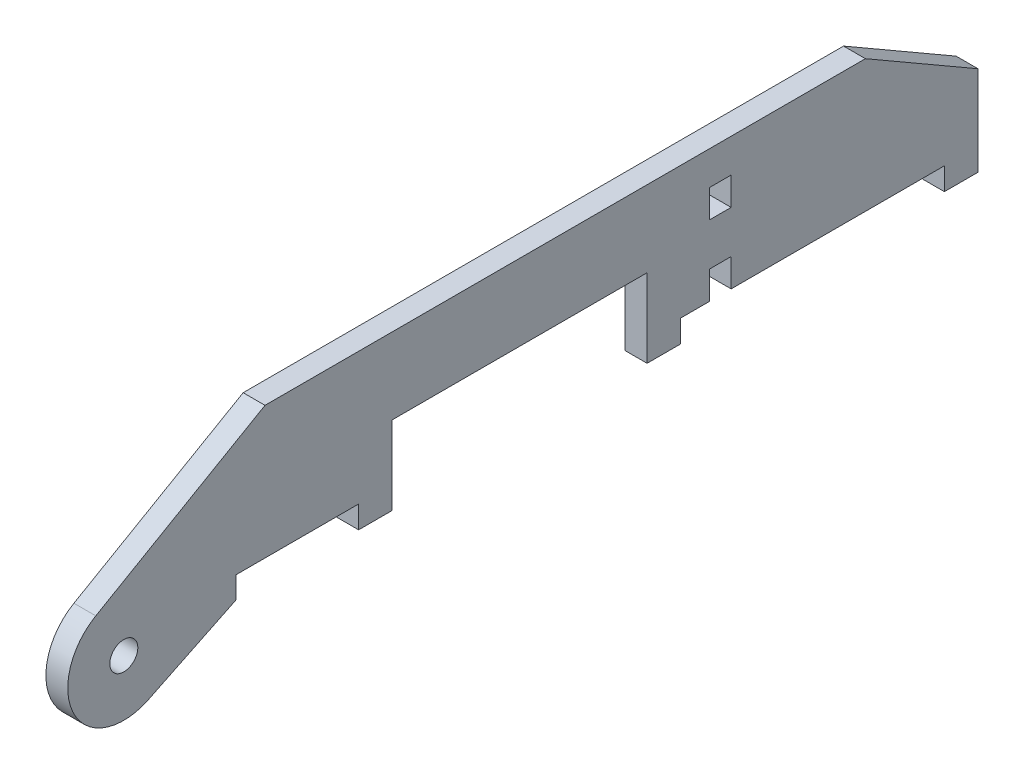
ISO-10303-21;
HEADER;
FILE_DESCRIPTION(('STEP AP214'),'2;1');
FILE_NAME('part.step','',(''),(''),'','','');
FILE_SCHEMA(('AUTOMOTIVE_DESIGN { 1 0 10303 214 1 1 1 1 }'));
ENDSEC;
DATA;
#1=APPLICATION_CONTEXT('core data for automotive mechanical design processes');
#2=APPLICATION_PROTOCOL_DEFINITION('international standard','automotive_design',2000,#1);
#3=PRODUCT_CONTEXT('',#1,'mechanical');
#4=PRODUCT('Part','Part','',(#3));
#5=PRODUCT_RELATED_PRODUCT_CATEGORY('part','',(#4));
#6=PRODUCT_DEFINITION_FORMATION('','',#4);
#7=PRODUCT_DEFINITION_CONTEXT('part definition',#1,'design');
#8=PRODUCT_DEFINITION('design','',#6,#7);
#9=PRODUCT_DEFINITION_SHAPE('','',#8);
#10=(LENGTH_UNIT() NAMED_UNIT(*) SI_UNIT(.MILLI.,.METRE.));
#11=(NAMED_UNIT(*) PLANE_ANGLE_UNIT() SI_UNIT($,.RADIAN.));
#12=(NAMED_UNIT(*) SI_UNIT($,.STERADIAN.) SOLID_ANGLE_UNIT());
#13=UNCERTAINTY_MEASURE_WITH_UNIT(LENGTH_MEASURE(1.E-05),#10,'distance_accuracy_value','');
#14=(GEOMETRIC_REPRESENTATION_CONTEXT(3) GLOBAL_UNCERTAINTY_ASSIGNED_CONTEXT((#13)) GLOBAL_UNIT_ASSIGNED_CONTEXT((#10,
#11,#12)) REPRESENTATION_CONTEXT('',''));
#15=CARTESIAN_POINT('',(0.,0.,0.));
#16=DIRECTION('',(0.,0.,1.));
#17=DIRECTION('',(1.,0.,0.));
#18=AXIS2_PLACEMENT_3D('',#15,#16,#17);
#19=CARTESIAN_POINT('',(2.4765,51.3143053538504,147.857292876109));
#20=DIRECTION('',(1.,0.,0.));
#21=DIRECTION('',(0.,0.,-1.));
#22=AXIS2_PLACEMENT_3D('',#19,#20,#21);
#23=PLANE('',#22);
#24=DIRECTION('',(0.,1.,0.));
#25=VECTOR('',#24,1.);
#26=CARTESIAN_POINT('',(2.4765,54.483,122.457292876109));
#27=LINE('',#26,#25);
#28=CARTESIAN_POINT('',(2.4765,49.53,122.457292876109));
#29=VERTEX_POINT('',#28);
#30=CARTESIAN_POINT('',(2.4765,54.483,122.457292876109));
#31=VERTEX_POINT('',#30);
#32=EDGE_CURVE('E248',#29,#31,#27,.T.);
#33=ORIENTED_EDGE('',*,*,#32,.T.);
#34=DIRECTION('',(0.,0.,-1.));
#35=VECTOR('',#34,1.);
#36=CARTESIAN_POINT('',(2.4765,54.483,94.6423658094959));
#37=LINE('',#36,#35);
#38=CARTESIAN_POINT('',(2.4765,54.483,94.6423658094959));
#39=VERTEX_POINT('',#38);
#40=EDGE_CURVE('E251',#31,#39,#37,.T.);
#41=ORIENTED_EDGE('',*,*,#40,.T.);
#42=DIRECTION('',(0.,-1.,0.));
#43=VECTOR('',#42,1.);
#44=CARTESIAN_POINT('',(2.4765,54.483,94.6423658094959));
#45=LINE('',#44,#43);
#46=CARTESIAN_POINT('',(2.4765,49.403,94.6423658094959));
#47=VERTEX_POINT('',#46);
#48=EDGE_CURVE('E254',#39,#47,#45,.T.);
#49=ORIENTED_EDGE('',*,*,#48,.T.);
#50=DIRECTION('',(0.,0.,-1.));
#51=VECTOR('',#50,1.);
#52=CARTESIAN_POINT('',(2.4765,49.403,87.022365809496));
#53=LINE('',#52,#51);
#54=CARTESIAN_POINT('',(2.4765,49.403,87.022365809496));
#55=VERTEX_POINT('',#54);
#56=EDGE_CURVE('E256',#47,#55,#53,.T.);
#57=ORIENTED_EDGE('',*,*,#56,.T.);
#58=DIRECTION('',(0.,1.,0.));
#59=VECTOR('',#58,1.);
#60=CARTESIAN_POINT('',(2.4765,49.403,87.022365809496));
#61=LINE('',#60,#59);
#62=CARTESIAN_POINT('',(2.4765,67.183,87.022365809496));
#63=VERTEX_POINT('',#62);
#64=EDGE_CURVE('E258',#55,#63,#61,.T.);
#65=ORIENTED_EDGE('',*,*,#64,.T.);
#66=DIRECTION('',(0.,0.,-1.));
#67=VECTOR('',#66,1.);
#68=CARTESIAN_POINT('',(2.4765,67.183,87.022365809496));
#69=LINE('',#68,#67);
#70=CARTESIAN_POINT('',(2.4765,67.183,29.2718566261337));
#71=VERTEX_POINT('',#70);
#72=EDGE_CURVE('E260',#63,#71,#69,.T.);
#73=ORIENTED_EDGE('',*,*,#72,.T.);
#74=DIRECTION('',(0.,-1.,0.));
#75=VECTOR('',#74,1.);
#76=CARTESIAN_POINT('',(2.4765,49.403,29.2718566261337));
#77=LINE('',#76,#75);
#78=CARTESIAN_POINT('',(2.4765,49.403,29.2718566261337));
#79=VERTEX_POINT('',#78);
#80=EDGE_CURVE('E262',#71,#79,#77,.T.);
#81=ORIENTED_EDGE('',*,*,#80,.T.);
#82=DIRECTION('',(0.,0.,-1.));
#83=VECTOR('',#82,1.);
#84=CARTESIAN_POINT('',(2.4765,49.403,29.2718566261337));
#85=LINE('',#84,#83);
#86=CARTESIAN_POINT('',(2.4765,49.403,21.6518566261337));
#87=VERTEX_POINT('',#86);
#88=EDGE_CURVE('E264',#79,#87,#85,.T.);
#89=ORIENTED_EDGE('',*,*,#88,.T.);
#90=DIRECTION('',(0.,1.,0.));
#91=VECTOR('',#90,1.);
#92=CARTESIAN_POINT('',(2.4765,54.483,21.6518566261337));
#93=LINE('',#92,#91);
#94=CARTESIAN_POINT('',(2.4765,54.483,21.6518566261337));
#95=VERTEX_POINT('',#94);
#96=EDGE_CURVE('E266',#87,#95,#93,.T.);
#97=ORIENTED_EDGE('',*,*,#96,.T.);
#98=DIRECTION('',(0.,0.,-1.));
#99=VECTOR('',#98,1.);
#100=CARTESIAN_POINT('',(2.4765,54.483,21.6518566261337));
#101=LINE('',#100,#99);
#102=CARTESIAN_POINT('',(2.4765,54.483,15.1765));
#103=VERTEX_POINT('',#102);
#104=EDGE_CURVE('E268',#95,#103,#101,.T.);
#105=ORIENTED_EDGE('',*,*,#104,.T.);
#106=DIRECTION('',(0.,1.,0.));
#107=VECTOR('',#106,1.);
#108=CARTESIAN_POINT('',(2.4765,54.483,15.1765));
#109=LINE('',#108,#107);
#110=CARTESIAN_POINT('',(2.4765,60.833,15.1765));
#111=VERTEX_POINT('',#110);
#112=EDGE_CURVE('E270',#103,#111,#109,.T.);
#113=ORIENTED_EDGE('',*,*,#112,.T.);
#114=DIRECTION('',(0.,0.,-1.));
#115=VECTOR('',#114,1.);
#116=CARTESIAN_POINT('',(2.4765,60.833,15.1765));
#117=LINE('',#116,#115);
#118=CARTESIAN_POINT('',(2.4765,60.833,10.2235));
#119=VERTEX_POINT('',#118);
#120=EDGE_CURVE('E272',#111,#119,#117,.T.);
#121=ORIENTED_EDGE('',*,*,#120,.T.);
#122=DIRECTION('',(0.,-1.,0.));
#123=VECTOR('',#122,1.);
#124=CARTESIAN_POINT('',(2.4765,54.483,10.2235));
#125=LINE('',#124,#123);
#126=CARTESIAN_POINT('',(2.4765,54.483,10.2235));
#127=VERTEX_POINT('',#126);
#128=EDGE_CURVE('E274',#119,#127,#125,.T.);
#129=ORIENTED_EDGE('',*,*,#128,.T.);
#130=DIRECTION('',(0.,0.,-1.));
#131=VECTOR('',#130,1.);
#132=CARTESIAN_POINT('',(2.4765,54.483,10.2235));
#133=LINE('',#132,#131);
#134=CARTESIAN_POINT('',(2.4765,54.483,-38.1));
#135=VERTEX_POINT('',#134);
#136=EDGE_CURVE('E276',#127,#135,#133,.T.);
#137=ORIENTED_EDGE('',*,*,#136,.T.);
#138=DIRECTION('',(0.,-1.,0.));
#139=VECTOR('',#138,1.);
#140=CARTESIAN_POINT('',(2.4765,54.483,-38.1));
#141=LINE('',#140,#139);
#142=CARTESIAN_POINT('',(2.4765,49.403,-38.1));
#143=VERTEX_POINT('',#142);
#144=EDGE_CURVE('E278',#135,#143,#141,.T.);
#145=ORIENTED_EDGE('',*,*,#144,.T.);
#146=DIRECTION('',(0.,0.,-1.));
#147=VECTOR('',#146,1.);
#148=CARTESIAN_POINT('',(2.4765,49.403,-45.72));
#149=LINE('',#148,#147);
#150=CARTESIAN_POINT('',(2.4765,49.403,-45.72));
#151=VERTEX_POINT('',#150);
#152=EDGE_CURVE('E280',#143,#151,#149,.T.);
#153=ORIENTED_EDGE('',*,*,#152,.T.);
#154=DIRECTION('',(0.,1.,0.));
#155=VECTOR('',#154,1.);
#156=CARTESIAN_POINT('',(2.4765,49.403,-45.72));
#157=LINE('',#156,#155);
#158=CARTESIAN_POINT('',(2.4765,69.723,-45.72));
#159=VERTEX_POINT('',#158);
#160=EDGE_CURVE('E282',#151,#159,#157,.T.);
#161=ORIENTED_EDGE('',*,*,#160,.T.);
#162=DIRECTION('',(0.,0.500000000000001,0.866025403784438));
#163=VECTOR('',#162,1.);
#164=CARTESIAN_POINT('',(2.4765,69.723,-45.72));
#165=LINE('',#164,#163);
#166=CARTESIAN_POINT('',(2.4765,84.455,-20.2034275028954));
#167=VERTEX_POINT('',#166);
#168=EDGE_CURVE('E284',#159,#167,#165,.T.);
#169=ORIENTED_EDGE('',*,*,#168,.T.);
#170=DIRECTION('',(0.,0.,1.));
#171=VECTOR('',#170,1.);
#172=CARTESIAN_POINT('',(2.4765,84.455,-20.2034275028954));
#173=LINE('',#172,#171);
#174=CARTESIAN_POINT('',(2.4765,84.455,115.855925950851));
#175=VERTEX_POINT('',#174);
#176=EDGE_CURVE('E286',#167,#175,#173,.T.);
#177=ORIENTED_EDGE('',*,*,#176,.T.);
#178=DIRECTION('',(0.,-0.499999999999995,0.866025403784442));
#179=VECTOR('',#178,1.);
#180=CARTESIAN_POINT('',(2.4765,62.3128279819128,154.207292876109));
#181=LINE('',#180,#179);
#182=CARTESIAN_POINT('',(2.4765,62.3128279819128,154.207292876109));
#183=VERTEX_POINT('',#182);
#184=EDGE_CURVE('E288',#175,#183,#181,.T.);
#185=ORIENTED_EDGE('',*,*,#184,.T.);
#186=CARTESIAN_POINT('',(2.4765,51.3143053538504,147.857292876109));
#187=DIRECTION('',(1.,0.,0.));
#188=DIRECTION('',(0.,0.,-1.));
#189=AXIS2_PLACEMENT_3D('',#186,#187,#188);
#190=CIRCLE('',#189,12.7);
#191=CARTESIAN_POINT('',(2.4765,39.8899589675904,142.309833128914));
#192=VERTEX_POINT('',#191);
#193=EDGE_CURVE('E290',#183,#192,#190,.T.);
#194=ORIENTED_EDGE('',*,*,#193,.T.);
#195=DIRECTION('',(0.,0.436807854109848,-0.899554833563774));
#196=VECTOR('',#195,1.);
#197=CARTESIAN_POINT('',(2.4765,49.53,122.457292876109));
#198=LINE('',#197,#196);
#199=EDGE_CURVE('E292',#192,#29,#198,.T.);
#200=ORIENTED_EDGE('',*,*,#199,.T.);
#201=EDGE_LOOP('',(#33,#41,#49,#57,#65,#73,#81,#89,#97,#105,#113,#121,#129,#137,#145,#153,#161,
#169,#177,#185,#194,#200));
#202=FACE_BOUND('',#201,.T.);
#203=CARTESIAN_POINT('',(2.4765,51.3143053538504,147.857292876109));
#204=DIRECTION('',(1.,0.,0.));
#205=DIRECTION('',(0.,0.,-1.));
#206=AXIS2_PLACEMENT_3D('',#203,#204,#205);
#207=CIRCLE('',#206,3.1749999999999);
#208=CARTESIAN_POINT('',(2.4765,51.3143053538504,144.682292876109));
#209=VERTEX_POINT('',#208);
#210=EDGE_CURVE('E242',#209,#209,#207,.T.);
#211=ORIENTED_EDGE('',*,*,#210,.F.);
#212=EDGE_LOOP('',(#211));
#213=FACE_BOUND('',#212,.T.);
#214=DIRECTION('',(0.,0.,1.));
#215=VECTOR('',#214,1.);
#216=CARTESIAN_POINT('',(2.4765,76.835,10.2235));
#217=LINE('',#216,#215);
#218=CARTESIAN_POINT('',(2.4765,76.835,10.2235));
#219=VERTEX_POINT('',#218);
#220=CARTESIAN_POINT('',(2.4765,76.835,15.1765));
#221=VERTEX_POINT('',#220);
#222=EDGE_CURVE('E214',#219,#221,#217,.T.);
#223=ORIENTED_EDGE('',*,*,#222,.F.);
#224=DIRECTION('',(0.,1.,0.));
#225=VECTOR('',#224,1.);
#226=CARTESIAN_POINT('',(2.4765,76.835,10.2235));
#227=LINE('',#226,#225);
#228=CARTESIAN_POINT('',(2.4765,70.485,10.2235));
#229=VERTEX_POINT('',#228);
#230=EDGE_CURVE('E206',#229,#219,#227,.T.);
#231=ORIENTED_EDGE('',*,*,#230,.F.);
#232=DIRECTION('',(0.,0.,-1.));
#233=VECTOR('',#232,1.);
#234=CARTESIAN_POINT('',(2.4765,70.485,10.2235));
#235=LINE('',#234,#233);
#236=CARTESIAN_POINT('',(2.4765,70.485,15.1765));
#237=VERTEX_POINT('',#236);
#238=EDGE_CURVE('E228',#237,#229,#235,.T.);
#239=ORIENTED_EDGE('',*,*,#238,.F.);
#240=DIRECTION('',(0.,-1.,0.));
#241=VECTOR('',#240,1.);
#242=CARTESIAN_POINT('',(2.4765,76.835,15.1765));
#243=LINE('',#242,#241);
#244=EDGE_CURVE('E226',#221,#237,#243,.T.);
#245=ORIENTED_EDGE('',*,*,#244,.F.);
#246=EDGE_LOOP('',(#223,#231,#239,#245));
#247=FACE_BOUND('',#246,.T.);
#248=ADVANCED_FACE('F33',(#202,#213,#247),#23,.T.);
#249=CARTESIAN_POINT('',(-2.4765,51.3143053538504,147.857292876109));
#250=DIRECTION('',(1.,0.,0.));
#251=DIRECTION('',(0.,0.,-1.));
#252=AXIS2_PLACEMENT_3D('',#249,#250,#251);
#253=PLANE('',#252);
#254=CARTESIAN_POINT('',(-2.4765,51.3143053538504,147.857292876109));
#255=DIRECTION('',(1.,0.,0.));
#256=DIRECTION('',(0.,0.,-1.));
#257=AXIS2_PLACEMENT_3D('',#254,#255,#256);
#258=CIRCLE('',#257,3.1749999999999);
#259=CARTESIAN_POINT('',(-2.4765,51.3143053538504,144.682292876109));
#260=VERTEX_POINT('',#259);
#261=EDGE_CURVE('E222',#260,#260,#258,.T.);
#262=ORIENTED_EDGE('',*,*,#261,.T.);
#263=EDGE_LOOP('',(#262));
#264=FACE_BOUND('',#263,.T.);
#265=DIRECTION('',(0.,1.,0.));
#266=VECTOR('',#265,1.);
#267=CARTESIAN_POINT('',(-2.4765,54.483,122.457292876109));
#268=LINE('',#267,#266);
#269=CARTESIAN_POINT('',(-2.4765,49.53,122.457292876109));
#270=VERTEX_POINT('',#269);
#271=CARTESIAN_POINT('',(-2.4765,54.483,122.457292876109));
#272=VERTEX_POINT('',#271);
#273=EDGE_CURVE('E245',#270,#272,#268,.T.);
#274=ORIENTED_EDGE('',*,*,#273,.F.);
#275=DIRECTION('',(0.,0.436807854109848,-0.899554833563774));
#276=VECTOR('',#275,1.);
#277=CARTESIAN_POINT('',(-2.4765,49.53,122.457292876109));
#278=LINE('',#277,#276);
#279=CARTESIAN_POINT('',(-2.4765,39.8899589675904,142.309833128914));
#280=VERTEX_POINT('',#279);
#281=EDGE_CURVE('E252',#280,#270,#278,.T.);
#282=ORIENTED_EDGE('',*,*,#281,.F.);
#283=CARTESIAN_POINT('',(-2.4765,51.3143053538504,147.857292876109));
#284=DIRECTION('',(1.,0.,0.));
#285=DIRECTION('',(0.,0.,-1.));
#286=AXIS2_PLACEMENT_3D('',#283,#284,#285);
#287=CIRCLE('',#286,12.7);
#288=CARTESIAN_POINT('',(-2.4765,62.3128279819128,154.207292876109));
#289=VERTEX_POINT('',#288);
#290=EDGE_CURVE('E335',#289,#280,#287,.T.);
#291=ORIENTED_EDGE('',*,*,#290,.F.);
#292=DIRECTION('',(0.,-0.499999999999995,0.866025403784442));
#293=VECTOR('',#292,1.);
#294=CARTESIAN_POINT('',(-2.4765,62.3128279819128,154.207292876109));
#295=LINE('',#294,#293);
#296=CARTESIAN_POINT('',(-2.4765,84.455,115.855925950851));
#297=VERTEX_POINT('',#296);
#298=EDGE_CURVE('E333',#297,#289,#295,.T.);
#299=ORIENTED_EDGE('',*,*,#298,.F.);
#300=DIRECTION('',(0.,0.,1.));
#301=VECTOR('',#300,1.);
#302=CARTESIAN_POINT('',(-2.4765,84.455,-20.2034275028954));
#303=LINE('',#302,#301);
#304=CARTESIAN_POINT('',(-2.4765,84.455,-20.2034275028954));
#305=VERTEX_POINT('',#304);
#306=EDGE_CURVE('E331',#305,#297,#303,.T.);
#307=ORIENTED_EDGE('',*,*,#306,.F.);
#308=DIRECTION('',(0.,0.500000000000001,0.866025403784438));
#309=VECTOR('',#308,1.);
#310=CARTESIAN_POINT('',(-2.4765,69.723,-45.72));
#311=LINE('',#310,#309);
#312=CARTESIAN_POINT('',(-2.4765,69.723,-45.72));
#313=VERTEX_POINT('',#312);
#314=EDGE_CURVE('E329',#313,#305,#311,.T.);
#315=ORIENTED_EDGE('',*,*,#314,.F.);
#316=DIRECTION('',(0.,1.,0.));
#317=VECTOR('',#316,1.);
#318=CARTESIAN_POINT('',(-2.4765,49.403,-45.72));
#319=LINE('',#318,#317);
#320=CARTESIAN_POINT('',(-2.4765,49.403,-45.72));
#321=VERTEX_POINT('',#320);
#322=EDGE_CURVE('E327',#321,#313,#319,.T.);
#323=ORIENTED_EDGE('',*,*,#322,.F.);
#324=DIRECTION('',(0.,0.,-1.));
#325=VECTOR('',#324,1.);
#326=CARTESIAN_POINT('',(-2.4765,49.403,-45.72));
#327=LINE('',#326,#325);
#328=CARTESIAN_POINT('',(-2.4765,49.403,-38.1));
#329=VERTEX_POINT('',#328);
#330=EDGE_CURVE('E325',#329,#321,#327,.T.);
#331=ORIENTED_EDGE('',*,*,#330,.F.);
#332=DIRECTION('',(0.,-1.,0.));
#333=VECTOR('',#332,1.);
#334=CARTESIAN_POINT('',(-2.4765,54.483,-38.1));
#335=LINE('',#334,#333);
#336=CARTESIAN_POINT('',(-2.4765,54.483,-38.1));
#337=VERTEX_POINT('',#336);
#338=EDGE_CURVE('E323',#337,#329,#335,.T.);
#339=ORIENTED_EDGE('',*,*,#338,.F.);
#340=DIRECTION('',(0.,0.,-1.));
#341=VECTOR('',#340,1.);
#342=CARTESIAN_POINT('',(-2.4765,54.483,10.2235));
#343=LINE('',#342,#341);
#344=CARTESIAN_POINT('',(-2.4765,54.483,10.2235));
#345=VERTEX_POINT('',#344);
#346=EDGE_CURVE('E321',#345,#337,#343,.T.);
#347=ORIENTED_EDGE('',*,*,#346,.F.);
#348=DIRECTION('',(0.,-1.,0.));
#349=VECTOR('',#348,1.);
#350=CARTESIAN_POINT('',(-2.4765,54.483,10.2235));
#351=LINE('',#350,#349);
#352=CARTESIAN_POINT('',(-2.4765,60.833,10.2235));
#353=VERTEX_POINT('',#352);
#354=EDGE_CURVE('E319',#353,#345,#351,.T.);
#355=ORIENTED_EDGE('',*,*,#354,.F.);
#356=DIRECTION('',(0.,0.,-1.));
#357=VECTOR('',#356,1.);
#358=CARTESIAN_POINT('',(-2.4765,60.833,15.1765));
#359=LINE('',#358,#357);
#360=CARTESIAN_POINT('',(-2.4765,60.833,15.1765));
#361=VERTEX_POINT('',#360);
#362=EDGE_CURVE('E317',#361,#353,#359,.T.);
#363=ORIENTED_EDGE('',*,*,#362,.F.);
#364=DIRECTION('',(0.,1.,0.));
#365=VECTOR('',#364,1.);
#366=CARTESIAN_POINT('',(-2.4765,54.483,15.1765));
#367=LINE('',#366,#365);
#368=CARTESIAN_POINT('',(-2.4765,54.483,15.1765));
#369=VERTEX_POINT('',#368);
#370=EDGE_CURVE('E315',#369,#361,#367,.T.);
#371=ORIENTED_EDGE('',*,*,#370,.F.);
#372=DIRECTION('',(0.,0.,-1.));
#373=VECTOR('',#372,1.);
#374=CARTESIAN_POINT('',(-2.4765,54.483,21.6518566261337));
#375=LINE('',#374,#373);
#376=CARTESIAN_POINT('',(-2.4765,54.483,21.6518566261337));
#377=VERTEX_POINT('',#376);
#378=EDGE_CURVE('E313',#377,#369,#375,.T.);
#379=ORIENTED_EDGE('',*,*,#378,.F.);
#380=DIRECTION('',(0.,1.,0.));
#381=VECTOR('',#380,1.);
#382=CARTESIAN_POINT('',(-2.4765,54.483,21.6518566261337));
#383=LINE('',#382,#381);
#384=CARTESIAN_POINT('',(-2.4765,49.403,21.6518566261337));
#385=VERTEX_POINT('',#384);
#386=EDGE_CURVE('E311',#385,#377,#383,.T.);
#387=ORIENTED_EDGE('',*,*,#386,.F.);
#388=DIRECTION('',(0.,0.,-1.));
#389=VECTOR('',#388,1.);
#390=CARTESIAN_POINT('',(-2.4765,49.403,29.2718566261337));
#391=LINE('',#390,#389);
#392=CARTESIAN_POINT('',(-2.4765,49.403,29.2718566261337));
#393=VERTEX_POINT('',#392);
#394=EDGE_CURVE('E309',#393,#385,#391,.T.);
#395=ORIENTED_EDGE('',*,*,#394,.F.);
#396=DIRECTION('',(0.,-1.,0.));
#397=VECTOR('',#396,1.);
#398=CARTESIAN_POINT('',(-2.4765,49.403,29.2718566261337));
#399=LINE('',#398,#397);
#400=CARTESIAN_POINT('',(-2.4765,67.183,29.2718566261337));
#401=VERTEX_POINT('',#400);
#402=EDGE_CURVE('E307',#401,#393,#399,.T.);
#403=ORIENTED_EDGE('',*,*,#402,.F.);
#404=DIRECTION('',(0.,0.,-1.));
#405=VECTOR('',#404,1.);
#406=CARTESIAN_POINT('',(-2.4765,67.183,87.022365809496));
#407=LINE('',#406,#405);
#408=CARTESIAN_POINT('',(-2.4765,67.183,87.022365809496));
#409=VERTEX_POINT('',#408);
#410=EDGE_CURVE('E305',#409,#401,#407,.T.);
#411=ORIENTED_EDGE('',*,*,#410,.F.);
#412=DIRECTION('',(0.,1.,0.));
#413=VECTOR('',#412,1.);
#414=CARTESIAN_POINT('',(-2.4765,49.403,87.022365809496));
#415=LINE('',#414,#413);
#416=CARTESIAN_POINT('',(-2.4765,49.403,87.022365809496));
#417=VERTEX_POINT('',#416);
#418=EDGE_CURVE('E303',#417,#409,#415,.T.);
#419=ORIENTED_EDGE('',*,*,#418,.F.);
#420=DIRECTION('',(0.,0.,-1.));
#421=VECTOR('',#420,1.);
#422=CARTESIAN_POINT('',(-2.4765,49.403,87.022365809496));
#423=LINE('',#422,#421);
#424=CARTESIAN_POINT('',(-2.4765,49.403,94.6423658094959));
#425=VERTEX_POINT('',#424);
#426=EDGE_CURVE('E301',#425,#417,#423,.T.);
#427=ORIENTED_EDGE('',*,*,#426,.F.);
#428=DIRECTION('',(0.,-1.,0.));
#429=VECTOR('',#428,1.);
#430=CARTESIAN_POINT('',(-2.4765,54.483,94.6423658094959));
#431=LINE('',#430,#429);
#432=CARTESIAN_POINT('',(-2.4765,54.483,94.6423658094959));
#433=VERTEX_POINT('',#432);
#434=EDGE_CURVE('E299',#433,#425,#431,.T.);
#435=ORIENTED_EDGE('',*,*,#434,.F.);
#436=DIRECTION('',(0.,0.,-1.));
#437=VECTOR('',#436,1.);
#438=CARTESIAN_POINT('',(-2.4765,54.483,94.6423658094959));
#439=LINE('',#438,#437);
#440=EDGE_CURVE('E297',#272,#433,#439,.T.);
#441=ORIENTED_EDGE('',*,*,#440,.F.);
#442=EDGE_LOOP('',(#274,#282,#291,#299,#307,#315,#323,#331,#339,#347,#355,#363,#371,#379,#387,
#395,#403,#411,#419,#427,#435,#441));
#443=FACE_BOUND('',#442,.T.);
#444=DIRECTION('',(0.,1.,0.));
#445=VECTOR('',#444,1.);
#446=CARTESIAN_POINT('',(-2.4765,76.835,10.2235));
#447=LINE('',#446,#445);
#448=CARTESIAN_POINT('',(-2.4765,70.485,10.2235));
#449=VERTEX_POINT('',#448);
#450=CARTESIAN_POINT('',(-2.4765,76.835,10.2235));
#451=VERTEX_POINT('',#450);
#452=EDGE_CURVE('E56',#449,#451,#447,.T.);
#453=ORIENTED_EDGE('',*,*,#452,.T.);
#454=DIRECTION('',(0.,0.,1.));
#455=VECTOR('',#454,1.);
#456=CARTESIAN_POINT('',(-2.4765,76.835,10.2235));
#457=LINE('',#456,#455);
#458=CARTESIAN_POINT('',(-2.4765,76.835,15.1765));
#459=VERTEX_POINT('',#458);
#460=EDGE_CURVE('E221',#451,#459,#457,.T.);
#461=ORIENTED_EDGE('',*,*,#460,.T.);
#462=DIRECTION('',(0.,-1.,0.));
#463=VECTOR('',#462,1.);
#464=CARTESIAN_POINT('',(-2.4765,76.835,15.1765));
#465=LINE('',#464,#463);
#466=CARTESIAN_POINT('',(-2.4765,70.485,15.1765));
#467=VERTEX_POINT('',#466);
#468=EDGE_CURVE('E234',#459,#467,#465,.T.);
#469=ORIENTED_EDGE('',*,*,#468,.T.);
#470=DIRECTION('',(0.,0.,-1.));
#471=VECTOR('',#470,1.);
#472=CARTESIAN_POINT('',(-2.4765,70.485,10.2235));
#473=LINE('',#472,#471);
#474=EDGE_CURVE('E215',#467,#449,#473,.T.);
#475=ORIENTED_EDGE('',*,*,#474,.T.);
#476=EDGE_LOOP('',(#453,#461,#469,#475));
#477=FACE_BOUND('',#476,.T.);
#478=ADVANCED_FACE('F407',(#264,#443,#477),#253,.F.);
#479=CARTESIAN_POINT('',(2.4765,54.483,122.457292876109));
#480=DIRECTION('',(0.,0.,1.));
#481=DIRECTION('',(1.,0.,0.));
#482=AXIS2_PLACEMENT_3D('',#479,#480,#481);
#483=PLANE('',#482);
#484=ORIENTED_EDGE('',*,*,#273,.T.);
#485=DIRECTION('',(-1.,0.,0.));
#486=VECTOR('',#485,1.);
#487=CARTESIAN_POINT('',(2.4765,54.483,122.457292876109));
#488=LINE('',#487,#486);
#489=EDGE_CURVE('E11',#31,#272,#488,.T.);
#490=ORIENTED_EDGE('',*,*,#489,.F.);
#491=ORIENTED_EDGE('',*,*,#32,.F.);
#492=DIRECTION('',(-1.,0.,0.));
#493=VECTOR('',#492,1.);
#494=CARTESIAN_POINT('',(2.4765,49.53,122.457292876109));
#495=LINE('',#494,#493);
#496=EDGE_CURVE('E294',#29,#270,#495,.T.);
#497=ORIENTED_EDGE('',*,*,#496,.T.);
#498=EDGE_LOOP('',(#484,#490,#491,#497));
#499=FACE_BOUND('',#498,.T.);
#500=ADVANCED_FACE('F35',(#499),#483,.F.);
#501=CARTESIAN_POINT('',(2.4765,54.483,94.6423658094959));
#502=DIRECTION('',(0.,1.,0.));
#503=DIRECTION('',(0.,0.,1.));
#504=AXIS2_PLACEMENT_3D('',#501,#502,#503);
#505=PLANE('',#504);
#506=ORIENTED_EDGE('',*,*,#440,.T.);
#507=DIRECTION('',(-1.,0.,0.));
#508=VECTOR('',#507,1.);
#509=CARTESIAN_POINT('',(2.4765,54.483,94.6423658094959));
#510=LINE('',#509,#508);
#511=EDGE_CURVE('E41',#39,#433,#510,.T.);
#512=ORIENTED_EDGE('',*,*,#511,.F.);
#513=ORIENTED_EDGE('',*,*,#40,.F.);
#514=ORIENTED_EDGE('',*,*,#489,.T.);
#515=EDGE_LOOP('',(#506,#512,#513,#514));
#516=FACE_BOUND('',#515,.T.);
#517=ADVANCED_FACE('F425',(#516),#505,.F.);
#518=CARTESIAN_POINT('',(2.4765,54.483,94.6423658094959));
#519=DIRECTION('',(0.,0.,-1.));
#520=DIRECTION('',(-1.,0.,0.));
#521=AXIS2_PLACEMENT_3D('',#518,#519,#520);
#522=PLANE('',#521);
#523=ORIENTED_EDGE('',*,*,#434,.T.);
#524=DIRECTION('',(-1.,0.,0.));
#525=VECTOR('',#524,1.);
#526=CARTESIAN_POINT('',(2.4765,49.403,94.6423658094959));
#527=LINE('',#526,#525);
#528=EDGE_CURVE('E394',#47,#425,#527,.T.);
#529=ORIENTED_EDGE('',*,*,#528,.F.);
#530=ORIENTED_EDGE('',*,*,#48,.F.);
#531=ORIENTED_EDGE('',*,*,#511,.T.);
#532=EDGE_LOOP('',(#523,#529,#530,#531));
#533=FACE_BOUND('',#532,.T.);
#534=ADVANCED_FACE('F401',(#533),#522,.F.);
#535=CARTESIAN_POINT('',(2.4765,49.403,87.022365809496));
#536=DIRECTION('',(0.,1.,0.));
#537=DIRECTION('',(0.,0.,1.));
#538=AXIS2_PLACEMENT_3D('',#535,#536,#537);
#539=PLANE('',#538);
#540=ORIENTED_EDGE('',*,*,#426,.T.);
#541=DIRECTION('',(-1.,0.,0.));
#542=VECTOR('',#541,1.);
#543=CARTESIAN_POINT('',(2.4765,49.403,87.022365809496));
#544=LINE('',#543,#542);
#545=EDGE_CURVE('E391',#55,#417,#544,.T.);
#546=ORIENTED_EDGE('',*,*,#545,.F.);
#547=ORIENTED_EDGE('',*,*,#56,.F.);
#548=ORIENTED_EDGE('',*,*,#528,.T.);
#549=EDGE_LOOP('',(#540,#546,#547,#548));
#550=FACE_BOUND('',#549,.T.);
#551=ADVANCED_FACE('F413',(#550),#539,.F.);
#552=CARTESIAN_POINT('',(2.4765,49.403,87.022365809496));
#553=DIRECTION('',(0.,0.,1.));
#554=DIRECTION('',(1.,0.,0.));
#555=AXIS2_PLACEMENT_3D('',#552,#553,#554);
#556=PLANE('',#555);
#557=ORIENTED_EDGE('',*,*,#418,.T.);
#558=DIRECTION('',(-1.,0.,0.));
#559=VECTOR('',#558,1.);
#560=CARTESIAN_POINT('',(2.4765,67.183,87.022365809496));
#561=LINE('',#560,#559);
#562=EDGE_CURVE('E388',#63,#409,#561,.T.);
#563=ORIENTED_EDGE('',*,*,#562,.F.);
#564=ORIENTED_EDGE('',*,*,#64,.F.);
#565=ORIENTED_EDGE('',*,*,#545,.T.);
#566=EDGE_LOOP('',(#557,#563,#564,#565));
#567=FACE_BOUND('',#566,.T.);
#568=ADVANCED_FACE('F417',(#567),#556,.F.);
#569=CARTESIAN_POINT('',(2.4765,67.183,87.022365809496));
#570=DIRECTION('',(0.,1.,0.));
#571=DIRECTION('',(0.,0.,1.));
#572=AXIS2_PLACEMENT_3D('',#569,#570,#571);
#573=PLANE('',#572);
#574=ORIENTED_EDGE('',*,*,#410,.T.);
#575=DIRECTION('',(-1.,0.,0.));
#576=VECTOR('',#575,1.);
#577=CARTESIAN_POINT('',(2.4765,67.183,29.2718566261337));
#578=LINE('',#577,#576);
#579=EDGE_CURVE('E385',#71,#401,#578,.T.);
#580=ORIENTED_EDGE('',*,*,#579,.F.);
#581=ORIENTED_EDGE('',*,*,#72,.F.);
#582=ORIENTED_EDGE('',*,*,#562,.T.);
#583=EDGE_LOOP('',(#574,#580,#581,#582));
#584=FACE_BOUND('',#583,.T.);
#585=ADVANCED_FACE('F508',(#584),#573,.F.);
#586=CARTESIAN_POINT('',(2.4765,49.403,29.2718566261337));
#587=DIRECTION('',(0.,0.,-1.));
#588=DIRECTION('',(-1.,0.,0.));
#589=AXIS2_PLACEMENT_3D('',#586,#587,#588);
#590=PLANE('',#589);
#591=ORIENTED_EDGE('',*,*,#402,.T.);
#592=DIRECTION('',(-1.,0.,0.));
#593=VECTOR('',#592,1.);
#594=CARTESIAN_POINT('',(2.4765,49.403,29.2718566261337));
#595=LINE('',#594,#593);
#596=EDGE_CURVE('E382',#79,#393,#595,.T.);
#597=ORIENTED_EDGE('',*,*,#596,.F.);
#598=ORIENTED_EDGE('',*,*,#80,.F.);
#599=ORIENTED_EDGE('',*,*,#579,.T.);
#600=EDGE_LOOP('',(#591,#597,#598,#599));
#601=FACE_BOUND('',#600,.T.);
#602=ADVANCED_FACE('F505',(#601),#590,.F.);
#603=CARTESIAN_POINT('',(2.4765,49.403,29.2718566261337));
#604=DIRECTION('',(0.,1.,0.));
#605=DIRECTION('',(0.,0.,1.));
#606=AXIS2_PLACEMENT_3D('',#603,#604,#605);
#607=PLANE('',#606);
#608=ORIENTED_EDGE('',*,*,#394,.T.);
#609=DIRECTION('',(-1.,0.,0.));
#610=VECTOR('',#609,1.);
#611=CARTESIAN_POINT('',(2.4765,49.403,21.6518566261337));
#612=LINE('',#611,#610);
#613=EDGE_CURVE('E379',#87,#385,#612,.T.);
#614=ORIENTED_EDGE('',*,*,#613,.F.);
#615=ORIENTED_EDGE('',*,*,#88,.F.);
#616=ORIENTED_EDGE('',*,*,#596,.T.);
#617=EDGE_LOOP('',(#608,#614,#615,#616));
#618=FACE_BOUND('',#617,.T.);
#619=ADVANCED_FACE('F501',(#618),#607,.F.);
#620=CARTESIAN_POINT('',(2.4765,54.483,21.6518566261337));
#621=DIRECTION('',(0.,0.,1.));
#622=DIRECTION('',(1.,0.,0.));
#623=AXIS2_PLACEMENT_3D('',#620,#621,#622);
#624=PLANE('',#623);
#625=ORIENTED_EDGE('',*,*,#386,.T.);
#626=DIRECTION('',(-1.,0.,0.));
#627=VECTOR('',#626,1.);
#628=CARTESIAN_POINT('',(2.4765,54.483,21.6518566261337));
#629=LINE('',#628,#627);
#630=EDGE_CURVE('E376',#95,#377,#629,.T.);
#631=ORIENTED_EDGE('',*,*,#630,.F.);
#632=ORIENTED_EDGE('',*,*,#96,.F.);
#633=ORIENTED_EDGE('',*,*,#613,.T.);
#634=EDGE_LOOP('',(#625,#631,#632,#633));
#635=FACE_BOUND('',#634,.T.);
#636=ADVANCED_FACE('F497',(#635),#624,.F.);
#637=CARTESIAN_POINT('',(2.4765,54.483,21.6518566261337));
#638=DIRECTION('',(0.,1.,0.));
#639=DIRECTION('',(0.,0.,1.));
#640=AXIS2_PLACEMENT_3D('',#637,#638,#639);
#641=PLANE('',#640);
#642=ORIENTED_EDGE('',*,*,#378,.T.);
#643=DIRECTION('',(-1.,0.,0.));
#644=VECTOR('',#643,1.);
#645=CARTESIAN_POINT('',(2.4765,54.483,15.1765));
#646=LINE('',#645,#644);
#647=EDGE_CURVE('E373',#103,#369,#646,.T.);
#648=ORIENTED_EDGE('',*,*,#647,.F.);
#649=ORIENTED_EDGE('',*,*,#104,.F.);
#650=ORIENTED_EDGE('',*,*,#630,.T.);
#651=EDGE_LOOP('',(#642,#648,#649,#650));
#652=FACE_BOUND('',#651,.T.);
#653=ADVANCED_FACE('F492',(#652),#641,.F.);
#654=CARTESIAN_POINT('',(2.4765,54.483,15.1765));
#655=DIRECTION('',(0.,0.,1.));
#656=DIRECTION('',(1.,0.,0.));
#657=AXIS2_PLACEMENT_3D('',#654,#655,#656);
#658=PLANE('',#657);
#659=ORIENTED_EDGE('',*,*,#370,.T.);
#660=DIRECTION('',(-1.,0.,0.));
#661=VECTOR('',#660,1.);
#662=CARTESIAN_POINT('',(2.4765,60.833,15.1765));
#663=LINE('',#662,#661);
#664=EDGE_CURVE('E370',#111,#361,#663,.T.);
#665=ORIENTED_EDGE('',*,*,#664,.F.);
#666=ORIENTED_EDGE('',*,*,#112,.F.);
#667=ORIENTED_EDGE('',*,*,#647,.T.);
#668=EDGE_LOOP('',(#659,#665,#666,#667));
#669=FACE_BOUND('',#668,.T.);
#670=ADVANCED_FACE('F486',(#669),#658,.F.);
#671=CARTESIAN_POINT('',(2.4765,60.833,15.1765));
#672=DIRECTION('',(0.,1.,0.));
#673=DIRECTION('',(0.,0.,1.));
#674=AXIS2_PLACEMENT_3D('',#671,#672,#673);
#675=PLANE('',#674);
#676=ORIENTED_EDGE('',*,*,#362,.T.);
#677=DIRECTION('',(-1.,0.,0.));
#678=VECTOR('',#677,1.);
#679=CARTESIAN_POINT('',(2.4765,60.833,10.2235));
#680=LINE('',#679,#678);
#681=EDGE_CURVE('E367',#119,#353,#680,.T.);
#682=ORIENTED_EDGE('',*,*,#681,.F.);
#683=ORIENTED_EDGE('',*,*,#120,.F.);
#684=ORIENTED_EDGE('',*,*,#664,.T.);
#685=EDGE_LOOP('',(#676,#682,#683,#684));
#686=FACE_BOUND('',#685,.T.);
#687=ADVANCED_FACE('F482',(#686),#675,.F.);
#688=CARTESIAN_POINT('',(2.4765,54.483,10.2235));
#689=DIRECTION('',(0.,0.,-1.));
#690=DIRECTION('',(-1.,0.,0.));
#691=AXIS2_PLACEMENT_3D('',#688,#689,#690);
#692=PLANE('',#691);
#693=ORIENTED_EDGE('',*,*,#354,.T.);
#694=DIRECTION('',(-1.,0.,0.));
#695=VECTOR('',#694,1.);
#696=CARTESIAN_POINT('',(2.4765,54.483,10.2235));
#697=LINE('',#696,#695);
#698=EDGE_CURVE('E364',#127,#345,#697,.T.);
#699=ORIENTED_EDGE('',*,*,#698,.F.);
#700=ORIENTED_EDGE('',*,*,#128,.F.);
#701=ORIENTED_EDGE('',*,*,#681,.T.);
#702=EDGE_LOOP('',(#693,#699,#700,#701));
#703=FACE_BOUND('',#702,.T.);
#704=ADVANCED_FACE('F477',(#703),#692,.F.);
#705=CARTESIAN_POINT('',(2.4765,54.483,10.2235));
#706=DIRECTION('',(0.,1.,0.));
#707=DIRECTION('',(0.,0.,1.));
#708=AXIS2_PLACEMENT_3D('',#705,#706,#707);
#709=PLANE('',#708);
#710=ORIENTED_EDGE('',*,*,#346,.T.);
#711=DIRECTION('',(-1.,0.,0.));
#712=VECTOR('',#711,1.);
#713=CARTESIAN_POINT('',(2.4765,54.483,-38.1));
#714=LINE('',#713,#712);
#715=EDGE_CURVE('E361',#135,#337,#714,.T.);
#716=ORIENTED_EDGE('',*,*,#715,.F.);
#717=ORIENTED_EDGE('',*,*,#136,.F.);
#718=ORIENTED_EDGE('',*,*,#698,.T.);
#719=EDGE_LOOP('',(#710,#716,#717,#718));
#720=FACE_BOUND('',#719,.T.);
#721=ADVANCED_FACE('F471',(#720),#709,.F.);
#722=CARTESIAN_POINT('',(2.4765,54.483,-38.1));
#723=DIRECTION('',(0.,0.,-1.));
#724=DIRECTION('',(-1.,0.,0.));
#725=AXIS2_PLACEMENT_3D('',#722,#723,#724);
#726=PLANE('',#725);
#727=ORIENTED_EDGE('',*,*,#338,.T.);
#728=DIRECTION('',(-1.,0.,0.));
#729=VECTOR('',#728,1.);
#730=CARTESIAN_POINT('',(2.4765,49.403,-38.1));
#731=LINE('',#730,#729);
#732=EDGE_CURVE('E358',#143,#329,#731,.T.);
#733=ORIENTED_EDGE('',*,*,#732,.F.);
#734=ORIENTED_EDGE('',*,*,#144,.F.);
#735=ORIENTED_EDGE('',*,*,#715,.T.);
#736=EDGE_LOOP('',(#727,#733,#734,#735));
#737=FACE_BOUND('',#736,.T.);
#738=ADVANCED_FACE('F467',(#737),#726,.F.);
#739=CARTESIAN_POINT('',(2.4765,49.403,-45.72));
#740=DIRECTION('',(0.,1.,0.));
#741=DIRECTION('',(0.,0.,1.));
#742=AXIS2_PLACEMENT_3D('',#739,#740,#741);
#743=PLANE('',#742);
#744=ORIENTED_EDGE('',*,*,#330,.T.);
#745=DIRECTION('',(-1.,0.,0.));
#746=VECTOR('',#745,1.);
#747=CARTESIAN_POINT('',(2.4765,49.403,-45.72));
#748=LINE('',#747,#746);
#749=EDGE_CURVE('E355',#151,#321,#748,.T.);
#750=ORIENTED_EDGE('',*,*,#749,.F.);
#751=ORIENTED_EDGE('',*,*,#152,.F.);
#752=ORIENTED_EDGE('',*,*,#732,.T.);
#753=EDGE_LOOP('',(#744,#750,#751,#752));
#754=FACE_BOUND('',#753,.T.);
#755=ADVANCED_FACE('F462',(#754),#743,.F.);
#756=CARTESIAN_POINT('',(2.4765,49.403,-45.72));
#757=DIRECTION('',(0.,0.,1.));
#758=DIRECTION('',(1.,0.,0.));
#759=AXIS2_PLACEMENT_3D('',#756,#757,#758);
#760=PLANE('',#759);
#761=ORIENTED_EDGE('',*,*,#322,.T.);
#762=DIRECTION('',(-1.,0.,0.));
#763=VECTOR('',#762,1.);
#764=CARTESIAN_POINT('',(2.4765,69.723,-45.72));
#765=LINE('',#764,#763);
#766=EDGE_CURVE('E352',#159,#313,#765,.T.);
#767=ORIENTED_EDGE('',*,*,#766,.F.);
#768=ORIENTED_EDGE('',*,*,#160,.F.);
#769=ORIENTED_EDGE('',*,*,#749,.T.);
#770=EDGE_LOOP('',(#761,#767,#768,#769));
#771=FACE_BOUND('',#770,.T.);
#772=ADVANCED_FACE('F456',(#771),#760,.F.);
#773=CARTESIAN_POINT('',(2.4765,69.723,-45.72));
#774=DIRECTION('',(0.,-0.866025403784438,0.500000000000001));
#775=DIRECTION('',(0.,-0.500000000000001,-0.866025403784438));
#776=AXIS2_PLACEMENT_3D('',#773,#774,#775);
#777=PLANE('',#776);
#778=ORIENTED_EDGE('',*,*,#314,.T.);
#779=DIRECTION('',(-1.,0.,0.));
#780=VECTOR('',#779,1.);
#781=CARTESIAN_POINT('',(2.4765,84.455,-20.2034275028954));
#782=LINE('',#781,#780);
#783=EDGE_CURVE('E349',#167,#305,#782,.T.);
#784=ORIENTED_EDGE('',*,*,#783,.F.);
#785=ORIENTED_EDGE('',*,*,#168,.F.);
#786=ORIENTED_EDGE('',*,*,#766,.T.);
#787=EDGE_LOOP('',(#778,#784,#785,#786));
#788=FACE_BOUND('',#787,.T.);
#789=ADVANCED_FACE('F452',(#788),#777,.F.);
#790=CARTESIAN_POINT('',(2.4765,84.455,-20.2034275028954));
#791=DIRECTION('',(0.,-1.,0.));
#792=DIRECTION('',(0.,0.,-1.));
#793=AXIS2_PLACEMENT_3D('',#790,#791,#792);
#794=PLANE('',#793);
#795=ORIENTED_EDGE('',*,*,#306,.T.);
#796=DIRECTION('',(-1.,0.,0.));
#797=VECTOR('',#796,1.);
#798=CARTESIAN_POINT('',(2.4765,84.455,115.855925950851));
#799=LINE('',#798,#797);
#800=EDGE_CURVE('E346',#175,#297,#799,.T.);
#801=ORIENTED_EDGE('',*,*,#800,.F.);
#802=ORIENTED_EDGE('',*,*,#176,.F.);
#803=ORIENTED_EDGE('',*,*,#783,.T.);
#804=EDGE_LOOP('',(#795,#801,#802,#803));
#805=FACE_BOUND('',#804,.T.);
#806=ADVANCED_FACE('F447',(#805),#794,.F.);
#807=CARTESIAN_POINT('',(2.4765,62.3128279819128,154.207292876109));
#808=DIRECTION('',(0.,-0.866025403784442,-0.499999999999995));
#809=DIRECTION('',(0.,0.499999999999995,-0.866025403784442));
#810=AXIS2_PLACEMENT_3D('',#807,#808,#809);
#811=PLANE('',#810);
#812=ORIENTED_EDGE('',*,*,#298,.T.);
#813=DIRECTION('',(-1.,0.,0.));
#814=VECTOR('',#813,1.);
#815=CARTESIAN_POINT('',(2.4765,62.3128279819128,154.207292876109));
#816=LINE('',#815,#814);
#817=EDGE_CURVE('E343',#183,#289,#816,.T.);
#818=ORIENTED_EDGE('',*,*,#817,.F.);
#819=ORIENTED_EDGE('',*,*,#184,.F.);
#820=ORIENTED_EDGE('',*,*,#800,.T.);
#821=EDGE_LOOP('',(#812,#818,#819,#820));
#822=FACE_BOUND('',#821,.T.);
#823=ADVANCED_FACE('F441',(#822),#811,.F.);
#824=CARTESIAN_POINT('',(2.4765,51.3143053538504,147.857292876109));
#825=DIRECTION('',(-1.,0.,0.));
#826=DIRECTION('',(0.,0.,1.));
#827=AXIS2_PLACEMENT_3D('',#824,#825,#826);
#828=CYLINDRICAL_SURFACE('',#827,12.7);
#829=ORIENTED_EDGE('',*,*,#290,.T.);
#830=DIRECTION('',(-1.,0.,0.));
#831=VECTOR('',#830,1.);
#832=CARTESIAN_POINT('',(2.4765,39.8899589675904,142.309833128914));
#833=LINE('',#832,#831);
#834=EDGE_CURVE('E340',#192,#280,#833,.T.);
#835=ORIENTED_EDGE('',*,*,#834,.F.);
#836=ORIENTED_EDGE('',*,*,#193,.F.);
#837=ORIENTED_EDGE('',*,*,#817,.T.);
#838=EDGE_LOOP('',(#829,#835,#836,#837));
#839=FACE_BOUND('',#838,.T.);
#840=ADVANCED_FACE('F437',(#839),#828,.T.);
#841=CARTESIAN_POINT('',(2.4765,49.53,122.457292876109));
#842=DIRECTION('',(0.,0.899554833563774,0.436807854109848));
#843=DIRECTION('',(0.,-0.436807854109848,0.899554833563774));
#844=AXIS2_PLACEMENT_3D('',#841,#842,#843);
#845=PLANE('',#844);
#846=ORIENTED_EDGE('',*,*,#281,.T.);
#847=ORIENTED_EDGE('',*,*,#496,.F.);
#848=ORIENTED_EDGE('',*,*,#199,.F.);
#849=ORIENTED_EDGE('',*,*,#834,.T.);
#850=EDGE_LOOP('',(#846,#847,#848,#849));
#851=FACE_BOUND('',#850,.T.);
#852=ADVANCED_FACE('F432',(#851),#845,.F.);
#853=CARTESIAN_POINT('',(2.4765,51.3143053538504,147.857292876109));
#854=DIRECTION('',(-1.,0.,0.));
#855=DIRECTION('',(0.,0.,1.));
#856=AXIS2_PLACEMENT_3D('',#853,#854,#855);
#857=CYLINDRICAL_SURFACE('',#856,3.1749999999999);
#858=ORIENTED_EDGE('',*,*,#210,.T.);
#859=EDGE_LOOP('',(#858));
#860=FACE_BOUND('',#859,.T.);
#861=ORIENTED_EDGE('',*,*,#261,.F.);
#862=EDGE_LOOP('',(#861));
#863=FACE_BOUND('',#862,.T.);
#864=ADVANCED_FACE('F525',(#860,#863),#857,.F.);
#865=CARTESIAN_POINT('',(2.4765,76.835,10.2235));
#866=DIRECTION('',(0.,0.,1.));
#867=DIRECTION('',(1.,0.,0.));
#868=AXIS2_PLACEMENT_3D('',#865,#866,#867);
#869=PLANE('',#868);
#870=ORIENTED_EDGE('',*,*,#452,.F.);
#871=DIRECTION('',(-1.,0.,0.));
#872=VECTOR('',#871,1.);
#873=CARTESIAN_POINT('',(2.4765,70.485,10.2235));
#874=LINE('',#873,#872);
#875=EDGE_CURVE('E210',#229,#449,#874,.T.);
#876=ORIENTED_EDGE('',*,*,#875,.F.);
#877=ORIENTED_EDGE('',*,*,#230,.T.);
#878=DIRECTION('',(-1.,0.,0.));
#879=VECTOR('',#878,1.);
#880=CARTESIAN_POINT('',(2.4765,76.835,10.2235));
#881=LINE('',#880,#879);
#882=EDGE_CURVE('E209',#219,#451,#881,.T.);
#883=ORIENTED_EDGE('',*,*,#882,.T.);
#884=EDGE_LOOP('',(#870,#876,#877,#883));
#885=FACE_BOUND('',#884,.T.);
#886=ADVANCED_FACE('F208',(#885),#869,.T.);
#887=CARTESIAN_POINT('',(2.4765,76.835,10.2235));
#888=DIRECTION('',(0.,-1.,0.));
#889=DIRECTION('',(0.,0.,-1.));
#890=AXIS2_PLACEMENT_3D('',#887,#888,#889);
#891=PLANE('',#890);
#892=ORIENTED_EDGE('',*,*,#460,.F.);
#893=ORIENTED_EDGE('',*,*,#882,.F.);
#894=ORIENTED_EDGE('',*,*,#222,.T.);
#895=DIRECTION('',(-1.,0.,0.));
#896=VECTOR('',#895,1.);
#897=CARTESIAN_POINT('',(2.4765,76.835,15.1765));
#898=LINE('',#897,#896);
#899=EDGE_CURVE('E223',#221,#459,#898,.T.);
#900=ORIENTED_EDGE('',*,*,#899,.T.);
#901=EDGE_LOOP('',(#892,#893,#894,#900));
#902=FACE_BOUND('',#901,.T.);
#903=ADVANCED_FACE('F218',(#902),#891,.T.);
#904=CARTESIAN_POINT('',(2.4765,76.835,15.1765));
#905=DIRECTION('',(0.,0.,-1.));
#906=DIRECTION('',(-1.,0.,0.));
#907=AXIS2_PLACEMENT_3D('',#904,#905,#906);
#908=PLANE('',#907);
#909=ORIENTED_EDGE('',*,*,#468,.F.);
#910=ORIENTED_EDGE('',*,*,#899,.F.);
#911=ORIENTED_EDGE('',*,*,#244,.T.);
#912=DIRECTION('',(-1.,0.,0.));
#913=VECTOR('',#912,1.);
#914=CARTESIAN_POINT('',(2.4765,70.485,15.1765));
#915=LINE('',#914,#913);
#916=EDGE_CURVE('E48',#237,#467,#915,.T.);
#917=ORIENTED_EDGE('',*,*,#916,.T.);
#918=EDGE_LOOP('',(#909,#910,#911,#917));
#919=FACE_BOUND('',#918,.T.);
#920=ADVANCED_FACE('F634',(#919),#908,.T.);
#921=CARTESIAN_POINT('',(2.4765,70.485,10.2235));
#922=DIRECTION('',(0.,1.,0.));
#923=DIRECTION('',(0.,0.,1.));
#924=AXIS2_PLACEMENT_3D('',#921,#922,#923);
#925=PLANE('',#924);
#926=ORIENTED_EDGE('',*,*,#474,.F.);
#927=ORIENTED_EDGE('',*,*,#916,.F.);
#928=ORIENTED_EDGE('',*,*,#238,.T.);
#929=ORIENTED_EDGE('',*,*,#875,.T.);
#930=EDGE_LOOP('',(#926,#927,#928,#929));
#931=FACE_BOUND('',#930,.T.);
#932=ADVANCED_FACE('F641',(#931),#925,.T.);
#933=CLOSED_SHELL('',(#248,#478,#500,#517,#534,#551,#568,#585,#602,#619,#636,#653,#670,#687,
#704,#721,#738,#755,#772,#789,#806,#823,#840,#852,#864,#886,#903,#920,#932));
#934=MANIFOLD_SOLID_BREP('B2',#933);
#935=ADVANCED_BREP_SHAPE_REPRESENTATION('',(#18,#934),#14);
#936=SHAPE_DEFINITION_REPRESENTATION(#9,#935);
ENDSEC;
END-ISO-10303-21;
